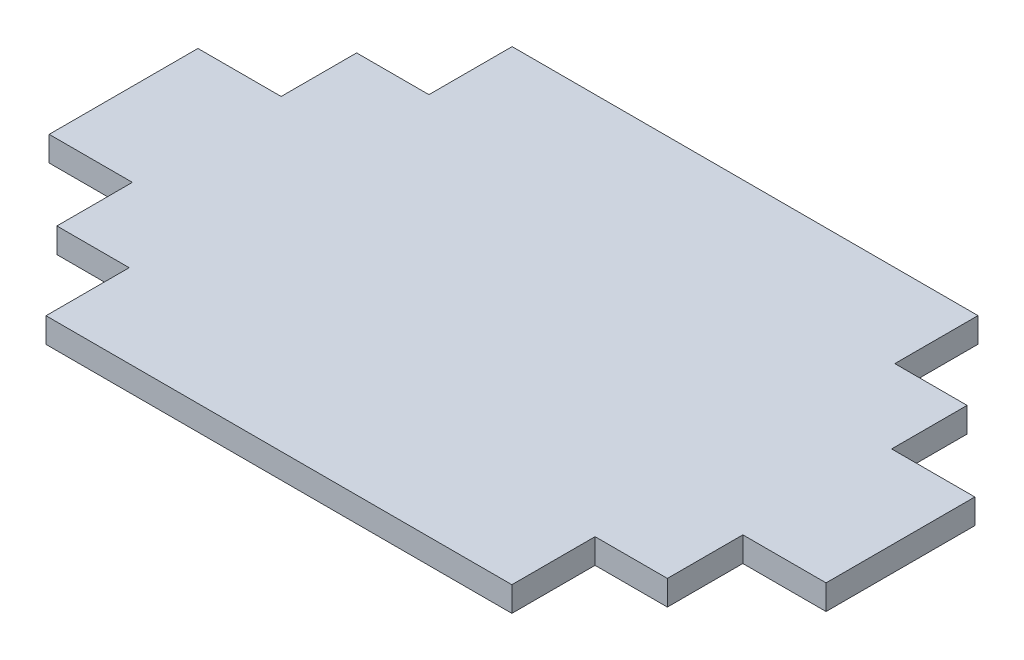
ISO-10303-21;
HEADER;
FILE_DESCRIPTION(('STEP AP214'),'2;1');
FILE_NAME('part.step','',(''),(''),'','','');
FILE_SCHEMA(('AUTOMOTIVE_DESIGN { 1 0 10303 214 1 1 1 1 }'));
ENDSEC;
DATA;
#1=APPLICATION_CONTEXT('core data for automotive mechanical design processes');
#2=APPLICATION_PROTOCOL_DEFINITION('international standard','automotive_design',2000,#1);
#3=PRODUCT_CONTEXT('',#1,'mechanical');
#4=PRODUCT('Part','Part','',(#3));
#5=PRODUCT_RELATED_PRODUCT_CATEGORY('part','',(#4));
#6=PRODUCT_DEFINITION_FORMATION('','',#4);
#7=PRODUCT_DEFINITION_CONTEXT('part definition',#1,'design');
#8=PRODUCT_DEFINITION('design','',#6,#7);
#9=PRODUCT_DEFINITION_SHAPE('','',#8);
#10=(LENGTH_UNIT() NAMED_UNIT(*) SI_UNIT(.MILLI.,.METRE.));
#11=(NAMED_UNIT(*) PLANE_ANGLE_UNIT() SI_UNIT($,.RADIAN.));
#12=(NAMED_UNIT(*) SI_UNIT($,.STERADIAN.) SOLID_ANGLE_UNIT());
#13=UNCERTAINTY_MEASURE_WITH_UNIT(LENGTH_MEASURE(1.E-05),#10,'distance_accuracy_value','');
#14=(GEOMETRIC_REPRESENTATION_CONTEXT(3) GLOBAL_UNCERTAINTY_ASSIGNED_CONTEXT((#13)) GLOBAL_UNIT_ASSIGNED_CONTEXT((#10,
#11,#12)) REPRESENTATION_CONTEXT('',''));
#15=CARTESIAN_POINT('',(0.,0.,0.));
#16=DIRECTION('',(0.,0.,1.));
#17=DIRECTION('',(1.,0.,0.));
#18=AXIS2_PLACEMENT_3D('',#15,#16,#17);
#19=CARTESIAN_POINT('',(0.,12.7,0.));
#20=DIRECTION('',(1.,0.,0.));
#21=DIRECTION('',(0.,0.,-1.));
#22=AXIS2_PLACEMENT_3D('',#19,#20,#21);
#23=PLANE('',#22);
#24=DIRECTION('',(0.,0.,1.));
#25=VECTOR('',#24,1.);
#26=CARTESIAN_POINT('',(0.,0.,0.));
#27=LINE('',#26,#25);
#28=CARTESIAN_POINT('',(0.,0.,81.0625));
#29=VERTEX_POINT('',#28);
#30=CARTESIAN_POINT('',(0.,0.,157.0625));
#31=VERTEX_POINT('',#30);
#32=EDGE_CURVE('E211',#29,#31,#27,.T.);
#33=ORIENTED_EDGE('',*,*,#32,.T.);
#34=DIRECTION('',(0.,1.,0.));
#35=VECTOR('',#34,1.);
#36=CARTESIAN_POINT('',(0.,0.,157.0625));
#37=LINE('',#36,#35);
#38=CARTESIAN_POINT('',(0.,12.7,157.0625));
#39=VERTEX_POINT('',#38);
#40=EDGE_CURVE('E339',#31,#39,#37,.T.);
#41=ORIENTED_EDGE('',*,*,#40,.T.);
#42=DIRECTION('',(0.,0.,1.));
#43=VECTOR('',#42,1.);
#44=CARTESIAN_POINT('',(0.,12.7,0.));
#45=LINE('',#44,#43);
#46=CARTESIAN_POINT('',(0.,12.7,81.0625));
#47=VERTEX_POINT('',#46);
#48=EDGE_CURVE('E203',#47,#39,#45,.T.);
#49=ORIENTED_EDGE('',*,*,#48,.F.);
#50=DIRECTION('',(0.,1.,0.));
#51=VECTOR('',#50,1.);
#52=CARTESIAN_POINT('',(0.,0.,81.0625));
#53=LINE('',#52,#51);
#54=EDGE_CURVE('E242',#29,#47,#53,.T.);
#55=ORIENTED_EDGE('',*,*,#54,.F.);
#56=EDGE_LOOP('',(#33,#41,#49,#55));
#57=FACE_BOUND('',#56,.T.);
#58=ADVANCED_FACE('F38',(#57),#23,.F.);
#59=CARTESIAN_POINT('',(0.,12.7,238.125));
#60=DIRECTION('',(0.,0.,-1.));
#61=DIRECTION('',(-1.,0.,0.));
#62=AXIS2_PLACEMENT_3D('',#59,#60,#61);
#63=PLANE('',#62);
#64=DIRECTION('',(1.,0.,0.));
#65=VECTOR('',#64,1.);
#66=CARTESIAN_POINT('',(0.,12.7,238.125));
#67=LINE('',#66,#65);
#68=CARTESIAN_POINT('',(79.4375,12.7,238.125));
#69=VERTEX_POINT('',#68);
#70=CARTESIAN_POINT('',(317.4375,12.7,238.125));
#71=VERTEX_POINT('',#70);
#72=EDGE_CURVE('E194',#69,#71,#67,.T.);
#73=ORIENTED_EDGE('',*,*,#72,.F.);
#74=DIRECTION('',(0.,1.,0.));
#75=VECTOR('',#74,1.);
#76=CARTESIAN_POINT('',(79.4375,0.,238.125));
#77=LINE('',#76,#75);
#78=CARTESIAN_POINT('',(79.4375,0.,238.125));
#79=VERTEX_POINT('',#78);
#80=EDGE_CURVE('E337',#79,#69,#77,.T.);
#81=ORIENTED_EDGE('',*,*,#80,.F.);
#82=DIRECTION('',(1.,0.,0.));
#83=VECTOR('',#82,1.);
#84=CARTESIAN_POINT('',(0.,0.,238.125));
#85=LINE('',#84,#83);
#86=CARTESIAN_POINT('',(317.4375,0.,238.125));
#87=VERTEX_POINT('',#86);
#88=EDGE_CURVE('E196',#79,#87,#85,.T.);
#89=ORIENTED_EDGE('',*,*,#88,.T.);
#90=DIRECTION('',(0.,1.,0.));
#91=VECTOR('',#90,1.);
#92=CARTESIAN_POINT('',(317.4375,0.,238.125));
#93=LINE('',#92,#91);
#94=EDGE_CURVE('E179',#87,#71,#93,.T.);
#95=ORIENTED_EDGE('',*,*,#94,.T.);
#96=EDGE_LOOP('',(#73,#81,#89,#95));
#97=FACE_BOUND('',#96,.T.);
#98=ADVANCED_FACE('F192',(#97),#63,.F.);
#99=CARTESIAN_POINT('',(396.875,12.7,0.));
#100=DIRECTION('',(-1.,0.,0.));
#101=DIRECTION('',(0.,0.,1.));
#102=AXIS2_PLACEMENT_3D('',#99,#100,#101);
#103=PLANE('',#102);
#104=DIRECTION('',(0.,0.,-1.));
#105=VECTOR('',#104,1.);
#106=CARTESIAN_POINT('',(396.875,0.,0.));
#107=LINE('',#106,#105);
#108=CARTESIAN_POINT('',(396.875,0.,157.0625));
#109=VERTEX_POINT('',#108);
#110=CARTESIAN_POINT('',(396.875,0.,81.0625));
#111=VERTEX_POINT('',#110);
#112=EDGE_CURVE('E215',#109,#111,#107,.T.);
#113=ORIENTED_EDGE('',*,*,#112,.T.);
#114=DIRECTION('',(0.,1.,0.));
#115=VECTOR('',#114,1.);
#116=CARTESIAN_POINT('',(396.875,0.,81.0625));
#117=LINE('',#116,#115);
#118=CARTESIAN_POINT('',(396.875,12.7,81.0625));
#119=VERTEX_POINT('',#118);
#120=EDGE_CURVE('E305',#111,#119,#117,.T.);
#121=ORIENTED_EDGE('',*,*,#120,.T.);
#122=DIRECTION('',(0.,0.,-1.));
#123=VECTOR('',#122,1.);
#124=CARTESIAN_POINT('',(396.875,12.7,0.));
#125=LINE('',#124,#123);
#126=CARTESIAN_POINT('',(396.875,12.7,157.0625));
#127=VERTEX_POINT('',#126);
#128=EDGE_CURVE('E46',#127,#119,#125,.T.);
#129=ORIENTED_EDGE('',*,*,#128,.F.);
#130=DIRECTION('',(0.,1.,0.));
#131=VECTOR('',#130,1.);
#132=CARTESIAN_POINT('',(396.875,0.,157.0625));
#133=LINE('',#132,#131);
#134=EDGE_CURVE('E351',#109,#127,#133,.T.);
#135=ORIENTED_EDGE('',*,*,#134,.F.);
#136=EDGE_LOOP('',(#113,#121,#129,#135));
#137=FACE_BOUND('',#136,.T.);
#138=ADVANCED_FACE('F369',(#137),#103,.F.);
#139=CARTESIAN_POINT('',(0.,12.7,0.));
#140=DIRECTION('',(0.,0.,1.));
#141=DIRECTION('',(1.,0.,0.));
#142=AXIS2_PLACEMENT_3D('',#139,#140,#141);
#143=PLANE('',#142);
#144=DIRECTION('',(-1.,0.,0.));
#145=VECTOR('',#144,1.);
#146=CARTESIAN_POINT('',(0.,12.7,0.));
#147=LINE('',#146,#145);
#148=CARTESIAN_POINT('',(317.4375,12.7,0.));
#149=VERTEX_POINT('',#148);
#150=CARTESIAN_POINT('',(79.4375,12.7,0.));
#151=VERTEX_POINT('',#150);
#152=EDGE_CURVE('E11',#149,#151,#147,.T.);
#153=ORIENTED_EDGE('',*,*,#152,.F.);
#154=DIRECTION('',(0.,1.,0.));
#155=VECTOR('',#154,1.);
#156=CARTESIAN_POINT('',(317.4375,0.,0.));
#157=LINE('',#156,#155);
#158=CARTESIAN_POINT('',(317.4375,0.,0.));
#159=VERTEX_POINT('',#158);
#160=EDGE_CURVE('E228',#159,#149,#157,.T.);
#161=ORIENTED_EDGE('',*,*,#160,.F.);
#162=DIRECTION('',(-1.,0.,0.));
#163=VECTOR('',#162,1.);
#164=CARTESIAN_POINT('',(0.,0.,0.));
#165=LINE('',#164,#163);
#166=CARTESIAN_POINT('',(79.4375,0.,0.));
#167=VERTEX_POINT('',#166);
#168=EDGE_CURVE('E41',#159,#167,#165,.T.);
#169=ORIENTED_EDGE('',*,*,#168,.T.);
#170=DIRECTION('',(0.,1.,0.));
#171=VECTOR('',#170,1.);
#172=CARTESIAN_POINT('',(79.4375,0.,0.));
#173=LINE('',#172,#171);
#174=EDGE_CURVE('E214',#167,#151,#173,.T.);
#175=ORIENTED_EDGE('',*,*,#174,.T.);
#176=EDGE_LOOP('',(#153,#161,#169,#175));
#177=FACE_BOUND('',#176,.T.);
#178=ADVANCED_FACE('F227',(#177),#143,.F.);
#179=CARTESIAN_POINT('',(0.,12.7,0.));
#180=DIRECTION('',(0.,1.,0.));
#181=DIRECTION('',(0.,0.,1.));
#182=AXIS2_PLACEMENT_3D('',#179,#180,#181);
#183=PLANE('',#182);
#184=DIRECTION('',(0.,0.,-1.));
#185=VECTOR('',#184,1.);
#186=CARTESIAN_POINT('',(79.4375,12.7,238.125));
#187=LINE('',#186,#185);
#188=CARTESIAN_POINT('',(79.4375,12.7,195.625));
#189=VERTEX_POINT('',#188);
#190=EDGE_CURVE('E202',#69,#189,#187,.T.);
#191=ORIENTED_EDGE('',*,*,#190,.F.);
#192=ORIENTED_EDGE('',*,*,#72,.T.);
#193=DIRECTION('',(0.,0.,1.));
#194=VECTOR('',#193,1.);
#195=CARTESIAN_POINT('',(317.4375,12.7,238.125));
#196=LINE('',#195,#194);
#197=CARTESIAN_POINT('',(317.4375,12.7,195.625));
#198=VERTEX_POINT('',#197);
#199=EDGE_CURVE('E175',#198,#71,#196,.T.);
#200=ORIENTED_EDGE('',*,*,#199,.F.);
#201=DIRECTION('',(-1.,0.,0.));
#202=VECTOR('',#201,1.);
#203=CARTESIAN_POINT('',(317.4375,12.7,195.625));
#204=LINE('',#203,#202);
#205=CARTESIAN_POINT('',(354.375,12.7,195.625));
#206=VERTEX_POINT('',#205);
#207=EDGE_CURVE('E186',#206,#198,#204,.T.);
#208=ORIENTED_EDGE('',*,*,#207,.F.);
#209=DIRECTION('',(0.,0.,1.));
#210=VECTOR('',#209,1.);
#211=CARTESIAN_POINT('',(354.375,12.7,157.0625));
#212=LINE('',#211,#210);
#213=CARTESIAN_POINT('',(354.375,12.7,157.0625));
#214=VERTEX_POINT('',#213);
#215=EDGE_CURVE('E354',#214,#206,#212,.T.);
#216=ORIENTED_EDGE('',*,*,#215,.F.);
#217=DIRECTION('',(-1.,0.,0.));
#218=VECTOR('',#217,1.);
#219=CARTESIAN_POINT('',(354.375,12.7,157.0625));
#220=LINE('',#219,#218);
#221=EDGE_CURVE('E306',#127,#214,#220,.T.);
#222=ORIENTED_EDGE('',*,*,#221,.F.);
#223=ORIENTED_EDGE('',*,*,#128,.T.);
#224=DIRECTION('',(1.,0.,0.));
#225=VECTOR('',#224,1.);
#226=CARTESIAN_POINT('',(354.375,12.7,81.0625));
#227=LINE('',#226,#225);
#228=CARTESIAN_POINT('',(354.375,12.7,81.0625));
#229=VERTEX_POINT('',#228);
#230=EDGE_CURVE('E285',#229,#119,#227,.T.);
#231=ORIENTED_EDGE('',*,*,#230,.F.);
#232=DIRECTION('',(0.,0.,1.));
#233=VECTOR('',#232,1.);
#234=CARTESIAN_POINT('',(354.375,12.7,81.0625));
#235=LINE('',#234,#233);
#236=CARTESIAN_POINT('',(354.375,12.7,42.5));
#237=VERTEX_POINT('',#236);
#238=EDGE_CURVE('E300',#237,#229,#235,.T.);
#239=ORIENTED_EDGE('',*,*,#238,.F.);
#240=DIRECTION('',(1.,0.,0.));
#241=VECTOR('',#240,1.);
#242=CARTESIAN_POINT('',(317.4375,12.7,42.5));
#243=LINE('',#242,#241);
#244=CARTESIAN_POINT('',(317.4375,12.7,42.5));
#245=VERTEX_POINT('',#244);
#246=EDGE_CURVE('E297',#245,#237,#243,.T.);
#247=ORIENTED_EDGE('',*,*,#246,.F.);
#248=DIRECTION('',(0.,0.,1.));
#249=VECTOR('',#248,1.);
#250=CARTESIAN_POINT('',(317.4375,12.7,0.));
#251=LINE('',#250,#249);
#252=EDGE_CURVE('E293',#149,#245,#251,.T.);
#253=ORIENTED_EDGE('',*,*,#252,.F.);
#254=ORIENTED_EDGE('',*,*,#152,.T.);
#255=DIRECTION('',(0.,0.,-1.));
#256=VECTOR('',#255,1.);
#257=CARTESIAN_POINT('',(79.4375,12.7,0.));
#258=LINE('',#257,#256);
#259=CARTESIAN_POINT('',(79.4375,12.7,42.5));
#260=VERTEX_POINT('',#259);
#261=EDGE_CURVE('E259',#260,#151,#258,.T.);
#262=ORIENTED_EDGE('',*,*,#261,.F.);
#263=DIRECTION('',(1.,0.,0.));
#264=VECTOR('',#263,1.);
#265=CARTESIAN_POINT('',(79.4375,12.7,42.5));
#266=LINE('',#265,#264);
#267=CARTESIAN_POINT('',(42.5,12.7,42.5));
#268=VERTEX_POINT('',#267);
#269=EDGE_CURVE('E256',#268,#260,#266,.T.);
#270=ORIENTED_EDGE('',*,*,#269,.F.);
#271=DIRECTION('',(0.,0.,-1.));
#272=VECTOR('',#271,1.);
#273=CARTESIAN_POINT('',(42.5,12.7,81.0625));
#274=LINE('',#273,#272);
#275=CARTESIAN_POINT('',(42.5,12.7,81.0625));
#276=VERTEX_POINT('',#275);
#277=EDGE_CURVE('E252',#276,#268,#274,.T.);
#278=ORIENTED_EDGE('',*,*,#277,.F.);
#279=DIRECTION('',(1.,0.,0.));
#280=VECTOR('',#279,1.);
#281=CARTESIAN_POINT('',(42.5,12.7,81.0625));
#282=LINE('',#281,#280);
#283=EDGE_CURVE('E249',#47,#276,#282,.T.);
#284=ORIENTED_EDGE('',*,*,#283,.F.);
#285=ORIENTED_EDGE('',*,*,#48,.T.);
#286=DIRECTION('',(-1.,0.,0.));
#287=VECTOR('',#286,1.);
#288=CARTESIAN_POINT('',(42.5,12.7,157.0625));
#289=LINE('',#288,#287);
#290=CARTESIAN_POINT('',(42.5,12.7,157.0625));
#291=VERTEX_POINT('',#290);
#292=EDGE_CURVE('E329',#291,#39,#289,.T.);
#293=ORIENTED_EDGE('',*,*,#292,.F.);
#294=DIRECTION('',(0.,0.,-1.));
#295=VECTOR('',#294,1.);
#296=CARTESIAN_POINT('',(42.5,12.7,157.0625));
#297=LINE('',#296,#295);
#298=CARTESIAN_POINT('',(42.5,12.7,195.625));
#299=VERTEX_POINT('',#298);
#300=EDGE_CURVE('E253',#299,#291,#297,.T.);
#301=ORIENTED_EDGE('',*,*,#300,.F.);
#302=DIRECTION('',(-1.,0.,0.));
#303=VECTOR('',#302,1.);
#304=CARTESIAN_POINT('',(79.4375,12.7,195.625));
#305=LINE('',#304,#303);
#306=EDGE_CURVE('E316',#189,#299,#305,.T.);
#307=ORIENTED_EDGE('',*,*,#306,.F.);
#308=EDGE_LOOP('',(#191,#192,#200,#208,#216,#222,#223,#231,#239,#247,#253,#254,#262,#270,#278,
#284,#285,#293,#301,#307));
#309=FACE_BOUND('',#308,.T.);
#310=ADVANCED_FACE('F199',(#309),#183,.T.);
#311=CARTESIAN_POINT('',(0.,0.,0.));
#312=DIRECTION('',(0.,1.,0.));
#313=DIRECTION('',(0.,0.,1.));
#314=AXIS2_PLACEMENT_3D('',#311,#312,#313);
#315=PLANE('',#314);
#316=ORIENTED_EDGE('',*,*,#88,.F.);
#317=DIRECTION('',(0.,0.,-1.));
#318=VECTOR('',#317,1.);
#319=CARTESIAN_POINT('',(79.4375,0.,238.125));
#320=LINE('',#319,#318);
#321=CARTESIAN_POINT('',(79.4375,0.,195.625));
#322=VERTEX_POINT('',#321);
#323=EDGE_CURVE('E320',#79,#322,#320,.T.);
#324=ORIENTED_EDGE('',*,*,#323,.T.);
#325=DIRECTION('',(-1.,0.,0.));
#326=VECTOR('',#325,1.);
#327=CARTESIAN_POINT('',(79.4375,0.,195.625));
#328=LINE('',#327,#326);
#329=CARTESIAN_POINT('',(42.5,0.,195.625));
#330=VERTEX_POINT('',#329);
#331=EDGE_CURVE('E323',#322,#330,#328,.T.);
#332=ORIENTED_EDGE('',*,*,#331,.T.);
#333=DIRECTION('',(0.,0.,-1.));
#334=VECTOR('',#333,1.);
#335=CARTESIAN_POINT('',(42.5,0.,157.0625));
#336=LINE('',#335,#334);
#337=CARTESIAN_POINT('',(42.5,0.,157.0625));
#338=VERTEX_POINT('',#337);
#339=EDGE_CURVE('E313',#330,#338,#336,.T.);
#340=ORIENTED_EDGE('',*,*,#339,.T.);
#341=DIRECTION('',(-1.,0.,0.));
#342=VECTOR('',#341,1.);
#343=CARTESIAN_POINT('',(42.5,0.,157.0625));
#344=LINE('',#343,#342);
#345=EDGE_CURVE('E317',#338,#31,#344,.T.);
#346=ORIENTED_EDGE('',*,*,#345,.T.);
#347=ORIENTED_EDGE('',*,*,#32,.F.);
#348=DIRECTION('',(1.,0.,0.));
#349=VECTOR('',#348,1.);
#350=CARTESIAN_POINT('',(42.5,0.,81.0625));
#351=LINE('',#350,#349);
#352=CARTESIAN_POINT('',(42.5,0.,81.0625));
#353=VERTEX_POINT('',#352);
#354=EDGE_CURVE('E261',#29,#353,#351,.T.);
#355=ORIENTED_EDGE('',*,*,#354,.T.);
#356=DIRECTION('',(0.,0.,-1.));
#357=VECTOR('',#356,1.);
#358=CARTESIAN_POINT('',(42.5,0.,81.0625));
#359=LINE('',#358,#357);
#360=CARTESIAN_POINT('',(42.5,0.,42.5));
#361=VERTEX_POINT('',#360);
#362=EDGE_CURVE('E245',#353,#361,#359,.T.);
#363=ORIENTED_EDGE('',*,*,#362,.T.);
#364=DIRECTION('',(1.,0.,0.));
#365=VECTOR('',#364,1.);
#366=CARTESIAN_POINT('',(79.4375,0.,42.5));
#367=LINE('',#366,#365);
#368=CARTESIAN_POINT('',(79.4375,0.,42.5));
#369=VERTEX_POINT('',#368);
#370=EDGE_CURVE('E240',#361,#369,#367,.T.);
#371=ORIENTED_EDGE('',*,*,#370,.T.);
#372=DIRECTION('',(0.,0.,-1.));
#373=VECTOR('',#372,1.);
#374=CARTESIAN_POINT('',(79.4375,0.,0.));
#375=LINE('',#374,#373);
#376=EDGE_CURVE('E237',#369,#167,#375,.T.);
#377=ORIENTED_EDGE('',*,*,#376,.T.);
#378=ORIENTED_EDGE('',*,*,#168,.F.);
#379=DIRECTION('',(0.,0.,1.));
#380=VECTOR('',#379,1.);
#381=CARTESIAN_POINT('',(317.4375,0.,0.));
#382=LINE('',#381,#380);
#383=CARTESIAN_POINT('',(317.4375,0.,42.5));
#384=VERTEX_POINT('',#383);
#385=EDGE_CURVE('E234',#159,#384,#382,.T.);
#386=ORIENTED_EDGE('',*,*,#385,.T.);
#387=DIRECTION('',(1.,0.,0.));
#388=VECTOR('',#387,1.);
#389=CARTESIAN_POINT('',(317.4375,0.,42.5));
#390=LINE('',#389,#388);
#391=CARTESIAN_POINT('',(354.375,0.,42.5));
#392=VERTEX_POINT('',#391);
#393=EDGE_CURVE('E286',#384,#392,#390,.T.);
#394=ORIENTED_EDGE('',*,*,#393,.T.);
#395=DIRECTION('',(0.,0.,1.));
#396=VECTOR('',#395,1.);
#397=CARTESIAN_POINT('',(354.375,0.,81.0625));
#398=LINE('',#397,#396);
#399=CARTESIAN_POINT('',(354.375,0.,81.0625));
#400=VERTEX_POINT('',#399);
#401=EDGE_CURVE('E54',#392,#400,#398,.T.);
#402=ORIENTED_EDGE('',*,*,#401,.T.);
#403=DIRECTION('',(1.,0.,0.));
#404=VECTOR('',#403,1.);
#405=CARTESIAN_POINT('',(354.375,0.,81.0625));
#406=LINE('',#405,#404);
#407=EDGE_CURVE('E289',#400,#111,#406,.T.);
#408=ORIENTED_EDGE('',*,*,#407,.T.);
#409=ORIENTED_EDGE('',*,*,#112,.F.);
#410=DIRECTION('',(-1.,0.,0.));
#411=VECTOR('',#410,1.);
#412=CARTESIAN_POINT('',(354.375,0.,157.0625));
#413=LINE('',#412,#411);
#414=CARTESIAN_POINT('',(354.375,0.,157.0625));
#415=VERTEX_POINT('',#414);
#416=EDGE_CURVE('E187',#109,#415,#413,.T.);
#417=ORIENTED_EDGE('',*,*,#416,.T.);
#418=DIRECTION('',(0.,0.,1.));
#419=VECTOR('',#418,1.);
#420=CARTESIAN_POINT('',(354.375,0.,157.0625));
#421=LINE('',#420,#419);
#422=CARTESIAN_POINT('',(354.375,0.,195.625));
#423=VERTEX_POINT('',#422);
#424=EDGE_CURVE('E62',#415,#423,#421,.T.);
#425=ORIENTED_EDGE('',*,*,#424,.T.);
#426=DIRECTION('',(-1.,0.,0.));
#427=VECTOR('',#426,1.);
#428=CARTESIAN_POINT('',(317.4375,0.,195.625));
#429=LINE('',#428,#427);
#430=CARTESIAN_POINT('',(317.4375,0.,195.625));
#431=VERTEX_POINT('',#430);
#432=EDGE_CURVE('E346',#423,#431,#429,.T.);
#433=ORIENTED_EDGE('',*,*,#432,.T.);
#434=DIRECTION('',(0.,0.,1.));
#435=VECTOR('',#434,1.);
#436=CARTESIAN_POINT('',(317.4375,0.,238.125));
#437=LINE('',#436,#435);
#438=EDGE_CURVE('E349',#431,#87,#437,.T.);
#439=ORIENTED_EDGE('',*,*,#438,.T.);
#440=EDGE_LOOP('',(#316,#324,#332,#340,#346,#347,#355,#363,#371,#377,#378,#386,#394,#402,#408,
#409,#417,#425,#433,#439));
#441=FACE_BOUND('',#440,.T.);
#442=ADVANCED_FACE('F232',(#441),#315,.F.);
#443=CARTESIAN_POINT('',(79.4375,0.,0.));
#444=DIRECTION('',(1.,0.,0.));
#445=DIRECTION('',(0.,0.,-1.));
#446=AXIS2_PLACEMENT_3D('',#443,#444,#445);
#447=PLANE('',#446);
#448=ORIENTED_EDGE('',*,*,#261,.T.);
#449=ORIENTED_EDGE('',*,*,#174,.F.);
#450=ORIENTED_EDGE('',*,*,#376,.F.);
#451=DIRECTION('',(0.,1.,0.));
#452=VECTOR('',#451,1.);
#453=CARTESIAN_POINT('',(79.4375,0.,42.5));
#454=LINE('',#453,#452);
#455=EDGE_CURVE('E263',#369,#260,#454,.T.);
#456=ORIENTED_EDGE('',*,*,#455,.T.);
#457=EDGE_LOOP('',(#448,#449,#450,#456));
#458=FACE_BOUND('',#457,.T.);
#459=ADVANCED_FACE('F513',(#458),#447,.F.);
#460=CARTESIAN_POINT('',(79.4375,0.,42.5));
#461=DIRECTION('',(0.,0.,1.));
#462=DIRECTION('',(1.,0.,0.));
#463=AXIS2_PLACEMENT_3D('',#460,#461,#462);
#464=PLANE('',#463);
#465=ORIENTED_EDGE('',*,*,#269,.T.);
#466=ORIENTED_EDGE('',*,*,#455,.F.);
#467=ORIENTED_EDGE('',*,*,#370,.F.);
#468=DIRECTION('',(0.,1.,0.));
#469=VECTOR('',#468,1.);
#470=CARTESIAN_POINT('',(42.5,0.,42.5));
#471=LINE('',#470,#469);
#472=EDGE_CURVE('E265',#361,#268,#471,.T.);
#473=ORIENTED_EDGE('',*,*,#472,.T.);
#474=EDGE_LOOP('',(#465,#466,#467,#473));
#475=FACE_BOUND('',#474,.T.);
#476=ADVANCED_FACE('F280',(#475),#464,.F.);
#477=CARTESIAN_POINT('',(42.5,0.,81.0625));
#478=DIRECTION('',(1.,0.,0.));
#479=DIRECTION('',(0.,0.,-1.));
#480=AXIS2_PLACEMENT_3D('',#477,#478,#479);
#481=PLANE('',#480);
#482=ORIENTED_EDGE('',*,*,#277,.T.);
#483=ORIENTED_EDGE('',*,*,#472,.F.);
#484=ORIENTED_EDGE('',*,*,#362,.F.);
#485=DIRECTION('',(0.,1.,0.));
#486=VECTOR('',#485,1.);
#487=CARTESIAN_POINT('',(42.5,0.,81.0625));
#488=LINE('',#487,#486);
#489=EDGE_CURVE('E244',#353,#276,#488,.T.);
#490=ORIENTED_EDGE('',*,*,#489,.T.);
#491=EDGE_LOOP('',(#482,#483,#484,#490));
#492=FACE_BOUND('',#491,.T.);
#493=ADVANCED_FACE('F269',(#492),#481,.F.);
#494=CARTESIAN_POINT('',(42.5,0.,81.0625));
#495=DIRECTION('',(0.,0.,1.));
#496=DIRECTION('',(1.,0.,0.));
#497=AXIS2_PLACEMENT_3D('',#494,#495,#496);
#498=PLANE('',#497);
#499=ORIENTED_EDGE('',*,*,#283,.T.);
#500=ORIENTED_EDGE('',*,*,#489,.F.);
#501=ORIENTED_EDGE('',*,*,#354,.F.);
#502=ORIENTED_EDGE('',*,*,#54,.T.);
#503=EDGE_LOOP('',(#499,#500,#501,#502));
#504=FACE_BOUND('',#503,.T.);
#505=ADVANCED_FACE('F275',(#504),#498,.F.);
#506=CARTESIAN_POINT('',(317.4375,0.,238.125));
#507=DIRECTION('',(-1.,0.,0.));
#508=DIRECTION('',(0.,0.,1.));
#509=AXIS2_PLACEMENT_3D('',#506,#507,#508);
#510=PLANE('',#509);
#511=ORIENTED_EDGE('',*,*,#199,.T.);
#512=ORIENTED_EDGE('',*,*,#94,.F.);
#513=ORIENTED_EDGE('',*,*,#438,.F.);
#514=DIRECTION('',(0.,1.,0.));
#515=VECTOR('',#514,1.);
#516=CARTESIAN_POINT('',(317.4375,0.,195.625));
#517=LINE('',#516,#515);
#518=EDGE_CURVE('E181',#431,#198,#517,.T.);
#519=ORIENTED_EDGE('',*,*,#518,.T.);
#520=EDGE_LOOP('',(#511,#512,#513,#519));
#521=FACE_BOUND('',#520,.T.);
#522=ADVANCED_FACE('F177',(#521),#510,.F.);
#523=CARTESIAN_POINT('',(317.4375,0.,195.625));
#524=DIRECTION('',(0.,0.,-1.));
#525=DIRECTION('',(-1.,0.,0.));
#526=AXIS2_PLACEMENT_3D('',#523,#524,#525);
#527=PLANE('',#526);
#528=ORIENTED_EDGE('',*,*,#207,.T.);
#529=ORIENTED_EDGE('',*,*,#518,.F.);
#530=ORIENTED_EDGE('',*,*,#432,.F.);
#531=DIRECTION('',(0.,1.,0.));
#532=VECTOR('',#531,1.);
#533=CARTESIAN_POINT('',(354.375,0.,195.625));
#534=LINE('',#533,#532);
#535=EDGE_CURVE('E359',#423,#206,#534,.T.);
#536=ORIENTED_EDGE('',*,*,#535,.T.);
#537=EDGE_LOOP('',(#528,#529,#530,#536));
#538=FACE_BOUND('',#537,.T.);
#539=ADVANCED_FACE('F413',(#538),#527,.F.);
#540=CARTESIAN_POINT('',(354.375,0.,157.0625));
#541=DIRECTION('',(-1.,0.,0.));
#542=DIRECTION('',(0.,0.,1.));
#543=AXIS2_PLACEMENT_3D('',#540,#541,#542);
#544=PLANE('',#543);
#545=ORIENTED_EDGE('',*,*,#215,.T.);
#546=ORIENTED_EDGE('',*,*,#535,.F.);
#547=ORIENTED_EDGE('',*,*,#424,.F.);
#548=DIRECTION('',(0.,1.,0.));
#549=VECTOR('',#548,1.);
#550=CARTESIAN_POINT('',(354.375,0.,157.0625));
#551=LINE('',#550,#549);
#552=EDGE_CURVE('E361',#415,#214,#551,.T.);
#553=ORIENTED_EDGE('',*,*,#552,.T.);
#554=EDGE_LOOP('',(#545,#546,#547,#553));
#555=FACE_BOUND('',#554,.T.);
#556=ADVANCED_FACE('F389',(#555),#544,.F.);
#557=CARTESIAN_POINT('',(354.375,0.,157.0625));
#558=DIRECTION('',(0.,0.,-1.));
#559=DIRECTION('',(-1.,0.,0.));
#560=AXIS2_PLACEMENT_3D('',#557,#558,#559);
#561=PLANE('',#560);
#562=ORIENTED_EDGE('',*,*,#221,.T.);
#563=ORIENTED_EDGE('',*,*,#552,.F.);
#564=ORIENTED_EDGE('',*,*,#416,.F.);
#565=ORIENTED_EDGE('',*,*,#134,.T.);
#566=EDGE_LOOP('',(#562,#563,#564,#565));
#567=FACE_BOUND('',#566,.T.);
#568=ADVANCED_FACE('F365',(#567),#561,.F.);
#569=CARTESIAN_POINT('',(317.4375,0.,0.));
#570=DIRECTION('',(-1.,0.,0.));
#571=DIRECTION('',(0.,0.,1.));
#572=AXIS2_PLACEMENT_3D('',#569,#570,#571);
#573=PLANE('',#572);
#574=ORIENTED_EDGE('',*,*,#252,.T.);
#575=DIRECTION('',(0.,1.,0.));
#576=VECTOR('',#575,1.);
#577=CARTESIAN_POINT('',(317.4375,0.,42.5));
#578=LINE('',#577,#576);
#579=EDGE_CURVE('E292',#384,#245,#578,.T.);
#580=ORIENTED_EDGE('',*,*,#579,.F.);
#581=ORIENTED_EDGE('',*,*,#385,.F.);
#582=ORIENTED_EDGE('',*,*,#160,.T.);
#583=EDGE_LOOP('',(#574,#580,#581,#582));
#584=FACE_BOUND('',#583,.T.);
#585=ADVANCED_FACE('F381',(#584),#573,.F.);
#586=CARTESIAN_POINT('',(354.375,0.,81.0625));
#587=DIRECTION('',(0.,0.,1.));
#588=DIRECTION('',(1.,0.,0.));
#589=AXIS2_PLACEMENT_3D('',#586,#587,#588);
#590=PLANE('',#589);
#591=ORIENTED_EDGE('',*,*,#230,.T.);
#592=ORIENTED_EDGE('',*,*,#120,.F.);
#593=ORIENTED_EDGE('',*,*,#407,.F.);
#594=DIRECTION('',(0.,1.,0.));
#595=VECTOR('',#594,1.);
#596=CARTESIAN_POINT('',(354.375,0.,81.0625));
#597=LINE('',#596,#595);
#598=EDGE_CURVE('E308',#400,#229,#597,.T.);
#599=ORIENTED_EDGE('',*,*,#598,.T.);
#600=EDGE_LOOP('',(#591,#592,#593,#599));
#601=FACE_BOUND('',#600,.T.);
#602=ADVANCED_FACE('F372',(#601),#590,.F.);
#603=CARTESIAN_POINT('',(354.375,0.,81.0625));
#604=DIRECTION('',(-1.,0.,0.));
#605=DIRECTION('',(0.,0.,1.));
#606=AXIS2_PLACEMENT_3D('',#603,#604,#605);
#607=PLANE('',#606);
#608=ORIENTED_EDGE('',*,*,#238,.T.);
#609=ORIENTED_EDGE('',*,*,#598,.F.);
#610=ORIENTED_EDGE('',*,*,#401,.F.);
#611=DIRECTION('',(0.,1.,0.));
#612=VECTOR('',#611,1.);
#613=CARTESIAN_POINT('',(354.375,0.,42.5));
#614=LINE('',#613,#612);
#615=EDGE_CURVE('E310',#392,#237,#614,.T.);
#616=ORIENTED_EDGE('',*,*,#615,.T.);
#617=EDGE_LOOP('',(#608,#609,#610,#616));
#618=FACE_BOUND('',#617,.T.);
#619=ADVANCED_FACE('F378',(#618),#607,.F.);
#620=CARTESIAN_POINT('',(317.4375,0.,42.5));
#621=DIRECTION('',(0.,0.,1.));
#622=DIRECTION('',(1.,0.,0.));
#623=AXIS2_PLACEMENT_3D('',#620,#621,#622);
#624=PLANE('',#623);
#625=ORIENTED_EDGE('',*,*,#246,.T.);
#626=ORIENTED_EDGE('',*,*,#615,.F.);
#627=ORIENTED_EDGE('',*,*,#393,.F.);
#628=ORIENTED_EDGE('',*,*,#579,.T.);
#629=EDGE_LOOP('',(#625,#626,#627,#628));
#630=FACE_BOUND('',#629,.T.);
#631=ADVANCED_FACE('F375',(#630),#624,.F.);
#632=CARTESIAN_POINT('',(42.5,0.,157.0625));
#633=DIRECTION('',(1.,0.,0.));
#634=DIRECTION('',(0.,0.,-1.));
#635=AXIS2_PLACEMENT_3D('',#632,#633,#634);
#636=PLANE('',#635);
#637=ORIENTED_EDGE('',*,*,#300,.T.);
#638=DIRECTION('',(0.,1.,0.));
#639=VECTOR('',#638,1.);
#640=CARTESIAN_POINT('',(42.5,0.,157.0625));
#641=LINE('',#640,#639);
#642=EDGE_CURVE('E326',#338,#291,#641,.T.);
#643=ORIENTED_EDGE('',*,*,#642,.F.);
#644=ORIENTED_EDGE('',*,*,#339,.F.);
#645=DIRECTION('',(0.,1.,0.));
#646=VECTOR('',#645,1.);
#647=CARTESIAN_POINT('',(42.5,0.,195.625));
#648=LINE('',#647,#646);
#649=EDGE_CURVE('E296',#330,#299,#648,.T.);
#650=ORIENTED_EDGE('',*,*,#649,.T.);
#651=EDGE_LOOP('',(#637,#643,#644,#650));
#652=FACE_BOUND('',#651,.T.);
#653=ADVANCED_FACE('F405',(#652),#636,.F.);
#654=CARTESIAN_POINT('',(79.4375,0.,195.625));
#655=DIRECTION('',(0.,0.,-1.));
#656=DIRECTION('',(-1.,0.,0.));
#657=AXIS2_PLACEMENT_3D('',#654,#655,#656);
#658=PLANE('',#657);
#659=ORIENTED_EDGE('',*,*,#306,.T.);
#660=ORIENTED_EDGE('',*,*,#649,.F.);
#661=ORIENTED_EDGE('',*,*,#331,.F.);
#662=DIRECTION('',(0.,1.,0.));
#663=VECTOR('',#662,1.);
#664=CARTESIAN_POINT('',(79.4375,0.,195.625));
#665=LINE('',#664,#663);
#666=EDGE_CURVE('E335',#322,#189,#665,.T.);
#667=ORIENTED_EDGE('',*,*,#666,.T.);
#668=EDGE_LOOP('',(#659,#660,#661,#667));
#669=FACE_BOUND('',#668,.T.);
#670=ADVANCED_FACE('F408',(#669),#658,.F.);
#671=CARTESIAN_POINT('',(79.4375,0.,238.125));
#672=DIRECTION('',(1.,0.,0.));
#673=DIRECTION('',(0.,0.,-1.));
#674=AXIS2_PLACEMENT_3D('',#671,#672,#673);
#675=PLANE('',#674);
#676=ORIENTED_EDGE('',*,*,#190,.T.);
#677=ORIENTED_EDGE('',*,*,#666,.F.);
#678=ORIENTED_EDGE('',*,*,#323,.F.);
#679=ORIENTED_EDGE('',*,*,#80,.T.);
#680=EDGE_LOOP('',(#676,#677,#678,#679));
#681=FACE_BOUND('',#680,.T.);
#682=ADVANCED_FACE('F410',(#681),#675,.F.);
#683=CARTESIAN_POINT('',(42.5,0.,157.0625));
#684=DIRECTION('',(0.,0.,-1.));
#685=DIRECTION('',(-1.,0.,0.));
#686=AXIS2_PLACEMENT_3D('',#683,#684,#685);
#687=PLANE('',#686);
#688=ORIENTED_EDGE('',*,*,#292,.T.);
#689=ORIENTED_EDGE('',*,*,#40,.F.);
#690=ORIENTED_EDGE('',*,*,#345,.F.);
#691=ORIENTED_EDGE('',*,*,#642,.T.);
#692=EDGE_LOOP('',(#688,#689,#690,#691));
#693=FACE_BOUND('',#692,.T.);
#694=ADVANCED_FACE('F401',(#693),#687,.F.);
#695=CLOSED_SHELL('',(#58,#98,#138,#178,#310,#442,#459,#476,#493,#505,#522,#539,#556,#568,#585,
#602,#619,#631,#653,#670,#682,#694));
#696=MANIFOLD_SOLID_BREP('B2',#695);
#697=ADVANCED_BREP_SHAPE_REPRESENTATION('',(#18,#696),#14);
#698=SHAPE_DEFINITION_REPRESENTATION(#9,#697);
ENDSEC;
END-ISO-10303-21;
